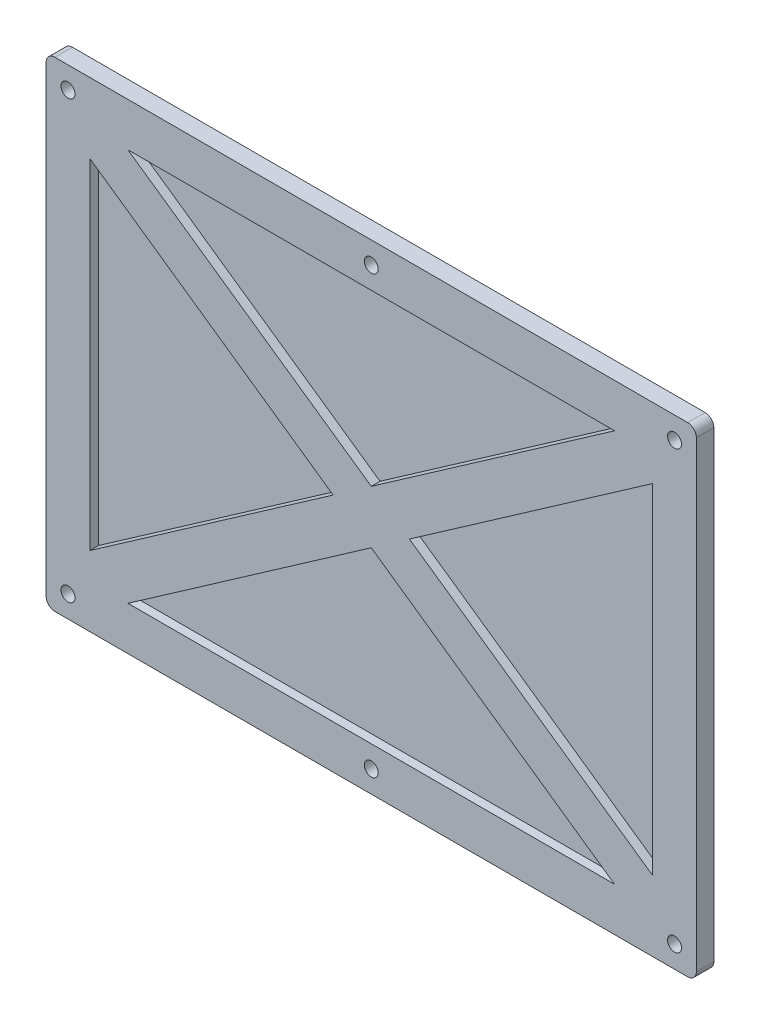
ISO-10303-21;
HEADER;
FILE_DESCRIPTION(('STEP AP214'),'2;1');
FILE_NAME('part.step','',(''),(''),'','','');
FILE_SCHEMA(('AUTOMOTIVE_DESIGN { 1 0 10303 214 1 1 1 1 }'));
ENDSEC;
DATA;
#1=APPLICATION_CONTEXT('core data for automotive mechanical design processes');
#2=APPLICATION_PROTOCOL_DEFINITION('international standard','automotive_design',2000,#1);
#3=PRODUCT_CONTEXT('',#1,'mechanical');
#4=PRODUCT('Part','Part','',(#3));
#5=PRODUCT_RELATED_PRODUCT_CATEGORY('part','',(#4));
#6=PRODUCT_DEFINITION_FORMATION('','',#4);
#7=PRODUCT_DEFINITION_CONTEXT('part definition',#1,'design');
#8=PRODUCT_DEFINITION('design','',#6,#7);
#9=PRODUCT_DEFINITION_SHAPE('','',#8);
#10=(LENGTH_UNIT() NAMED_UNIT(*) SI_UNIT(.MILLI.,.METRE.));
#11=(NAMED_UNIT(*) PLANE_ANGLE_UNIT() SI_UNIT($,.RADIAN.));
#12=(NAMED_UNIT(*) SI_UNIT($,.STERADIAN.) SOLID_ANGLE_UNIT());
#13=UNCERTAINTY_MEASURE_WITH_UNIT(LENGTH_MEASURE(1.E-05),#10,'distance_accuracy_value','');
#14=(GEOMETRIC_REPRESENTATION_CONTEXT(3) GLOBAL_UNCERTAINTY_ASSIGNED_CONTEXT((#13)) GLOBAL_UNIT_ASSIGNED_CONTEXT((#10,
#11,#12)) REPRESENTATION_CONTEXT('',''));
#15=CARTESIAN_POINT('',(0.,0.,0.));
#16=DIRECTION('',(0.,0.,1.));
#17=DIRECTION('',(1.,0.,0.));
#18=AXIS2_PLACEMENT_3D('',#15,#16,#17);
#19=CARTESIAN_POINT('',(0.,0.,0.));
#20=DIRECTION('',(0.,0.,-1.));
#21=DIRECTION('',(-1.,0.,0.));
#22=AXIS2_PLACEMENT_3D('',#19,#20,#21);
#23=PLANE('',#22);
#24=CARTESIAN_POINT('',(0.,50.,0.));
#25=DIRECTION('',(0.,0.,1.));
#26=DIRECTION('',(1.,0.,0.));
#27=AXIS2_PLACEMENT_3D('',#24,#25,#26);
#28=CIRCLE('',#27,1.6);
#29=CARTESIAN_POINT('',(1.60000000000001,50.,0.));
#30=VERTEX_POINT('',#29);
#31=EDGE_CURVE('E357',#30,#30,#28,.T.);
#32=ORIENTED_EDGE('',*,*,#31,.T.);
#33=EDGE_LOOP('',(#32));
#34=FACE_BOUND('',#33,.T.);
#35=CARTESIAN_POINT('',(69.5,-50.,0.));
#36=DIRECTION('',(0.,0.,1.));
#37=DIRECTION('',(1.,0.,0.));
#38=AXIS2_PLACEMENT_3D('',#35,#36,#37);
#39=CIRCLE('',#38,1.60000000000001);
#40=CARTESIAN_POINT('',(71.1,-50.,0.));
#41=VERTEX_POINT('',#40);
#42=EDGE_CURVE('E365',#41,#41,#39,.T.);
#43=ORIENTED_EDGE('',*,*,#42,.T.);
#44=EDGE_LOOP('',(#43));
#45=FACE_BOUND('',#44,.T.);
#46=CARTESIAN_POINT('',(-69.5,50.,0.));
#47=DIRECTION('',(0.,0.,1.));
#48=DIRECTION('',(1.,0.,0.));
#49=AXIS2_PLACEMENT_3D('',#46,#47,#48);
#50=CIRCLE('',#49,1.60000000000001);
#51=CARTESIAN_POINT('',(-67.9,50.,0.));
#52=VERTEX_POINT('',#51);
#53=EDGE_CURVE('E373',#52,#52,#50,.T.);
#54=ORIENTED_EDGE('',*,*,#53,.T.);
#55=EDGE_LOOP('',(#54));
#56=FACE_BOUND('',#55,.T.);
#57=DIRECTION('',(1.,0.,0.));
#58=VECTOR('',#57,1.);
#59=CARTESIAN_POINT('',(-74.5,-55.,0.));
#60=LINE('',#59,#58);
#61=CARTESIAN_POINT('',(-72.5,-55.,0.));
#62=VERTEX_POINT('',#61);
#63=CARTESIAN_POINT('',(72.5,-55.,0.));
#64=VERTEX_POINT('',#63);
#65=EDGE_CURVE('E388',#62,#64,#60,.T.);
#66=ORIENTED_EDGE('',*,*,#65,.F.);
#67=CARTESIAN_POINT('',(-72.5,-53.,0.));
#68=DIRECTION('',(0.,0.,-1.));
#69=DIRECTION('',(-1.,0.,0.));
#70=AXIS2_PLACEMENT_3D('',#67,#68,#69);
#71=CIRCLE('',#70,2.);
#72=CARTESIAN_POINT('',(-74.5,-53.,0.));
#73=VERTEX_POINT('',#72);
#74=EDGE_CURVE('E408',#62,#73,#71,.T.);
#75=ORIENTED_EDGE('',*,*,#74,.T.);
#76=DIRECTION('',(0.,-1.,0.));
#77=VECTOR('',#76,1.);
#78=CARTESIAN_POINT('',(-74.5,-55.,0.));
#79=LINE('',#78,#77);
#80=CARTESIAN_POINT('',(-74.5,53.,0.));
#81=VERTEX_POINT('',#80);
#82=EDGE_CURVE('E384',#81,#73,#79,.T.);
#83=ORIENTED_EDGE('',*,*,#82,.F.);
#84=CARTESIAN_POINT('',(-72.5,53.,0.));
#85=DIRECTION('',(0.,0.,-1.));
#86=DIRECTION('',(-1.,0.,0.));
#87=AXIS2_PLACEMENT_3D('',#84,#85,#86);
#88=CIRCLE('',#87,2.);
#89=CARTESIAN_POINT('',(-72.5,55.,0.));
#90=VERTEX_POINT('',#89);
#91=EDGE_CURVE('E399',#81,#90,#88,.T.);
#92=ORIENTED_EDGE('',*,*,#91,.T.);
#93=DIRECTION('',(-1.,0.,0.));
#94=VECTOR('',#93,1.);
#95=CARTESIAN_POINT('',(-74.5,55.,0.));
#96=LINE('',#95,#94);
#97=CARTESIAN_POINT('',(72.5,55.,0.));
#98=VERTEX_POINT('',#97);
#99=EDGE_CURVE('E380',#98,#90,#96,.T.);
#100=ORIENTED_EDGE('',*,*,#99,.F.);
#101=CARTESIAN_POINT('',(72.5,53.,0.));
#102=DIRECTION('',(0.,0.,-1.));
#103=DIRECTION('',(-1.,0.,0.));
#104=AXIS2_PLACEMENT_3D('',#101,#102,#103);
#105=CIRCLE('',#104,2.);
#106=CARTESIAN_POINT('',(74.5,53.,0.));
#107=VERTEX_POINT('',#106);
#108=EDGE_CURVE('E402',#98,#107,#105,.T.);
#109=ORIENTED_EDGE('',*,*,#108,.T.);
#110=DIRECTION('',(0.,1.,0.));
#111=VECTOR('',#110,1.);
#112=CARTESIAN_POINT('',(74.5,-55.,0.));
#113=LINE('',#112,#111);
#114=CARTESIAN_POINT('',(74.5,-53.,0.));
#115=VERTEX_POINT('',#114);
#116=EDGE_CURVE('E377',#115,#107,#113,.T.);
#117=ORIENTED_EDGE('',*,*,#116,.F.);
#118=CARTESIAN_POINT('',(72.5,-53.,0.));
#119=DIRECTION('',(0.,0.,-1.));
#120=DIRECTION('',(-1.,0.,0.));
#121=AXIS2_PLACEMENT_3D('',#118,#119,#120);
#122=CIRCLE('',#121,2.);
#123=EDGE_CURVE('E405',#115,#64,#122,.T.);
#124=ORIENTED_EDGE('',*,*,#123,.T.);
#125=EDGE_LOOP('',(#66,#75,#83,#92,#100,#109,#117,#124));
#126=FACE_BOUND('',#125,.T.);
#127=CARTESIAN_POINT('',(69.5,50.,0.));
#128=DIRECTION('',(0.,0.,1.));
#129=DIRECTION('',(1.,0.,0.));
#130=AXIS2_PLACEMENT_3D('',#127,#128,#129);
#131=CIRCLE('',#130,1.60000000000001);
#132=CARTESIAN_POINT('',(71.1,50.,0.));
#133=VERTEX_POINT('',#132);
#134=EDGE_CURVE('E369',#133,#133,#131,.T.);
#135=ORIENTED_EDGE('',*,*,#134,.T.);
#136=EDGE_LOOP('',(#135));
#137=FACE_BOUND('',#136,.T.);
#138=CARTESIAN_POINT('',(-69.5,-50.,0.));
#139=DIRECTION('',(0.,0.,1.));
#140=DIRECTION('',(1.,0.,0.));
#141=AXIS2_PLACEMENT_3D('',#138,#139,#140);
#142=CIRCLE('',#141,1.60000000000001);
#143=CARTESIAN_POINT('',(-67.9,-50.,0.));
#144=VERTEX_POINT('',#143);
#145=EDGE_CURVE('E361',#144,#144,#142,.T.);
#146=ORIENTED_EDGE('',*,*,#145,.T.);
#147=EDGE_LOOP('',(#146));
#148=FACE_BOUND('',#147,.T.);
#149=CARTESIAN_POINT('',(0.,-50.,0.));
#150=DIRECTION('',(0.,0.,1.));
#151=DIRECTION('',(1.,0.,0.));
#152=AXIS2_PLACEMENT_3D('',#149,#150,#151);
#153=CIRCLE('',#152,1.6);
#154=CARTESIAN_POINT('',(1.60000000000001,-50.,0.));
#155=VERTEX_POINT('',#154);
#156=EDGE_CURVE('E353',#155,#155,#153,.T.);
#157=ORIENTED_EDGE('',*,*,#156,.T.);
#158=EDGE_LOOP('',(#157));
#159=FACE_BOUND('',#158,.T.);
#160=ADVANCED_FACE('F42',(#34,#45,#56,#126,#137,#148,#159),#23,.T.);
#161=CARTESIAN_POINT('',(74.5,-55.,2.));
#162=DIRECTION('',(-1.,0.,0.));
#163=DIRECTION('',(0.,0.,1.));
#164=AXIS2_PLACEMENT_3D('',#161,#162,#163);
#165=PLANE('',#164);
#166=DIRECTION('',(0.,1.,0.));
#167=VECTOR('',#166,1.);
#168=CARTESIAN_POINT('',(74.5,-55.,4.));
#169=LINE('',#168,#167);
#170=CARTESIAN_POINT('',(74.5,-53.,4.));
#171=VERTEX_POINT('',#170);
#172=CARTESIAN_POINT('',(74.5,53.,4.));
#173=VERTEX_POINT('',#172);
#174=EDGE_CURVE('E350',#171,#173,#169,.T.);
#175=ORIENTED_EDGE('',*,*,#174,.F.);
#176=DIRECTION('',(0.,0.,-1.));
#177=VECTOR('',#176,1.);
#178=CARTESIAN_POINT('',(74.5,-53.,2.));
#179=LINE('',#178,#177);
#180=EDGE_CURVE('E431',#171,#115,#179,.T.);
#181=ORIENTED_EDGE('',*,*,#180,.T.);
#182=ORIENTED_EDGE('',*,*,#116,.T.);
#183=DIRECTION('',(0.,0.,-1.));
#184=VECTOR('',#183,1.);
#185=CARTESIAN_POINT('',(74.5,53.,2.));
#186=LINE('',#185,#184);
#187=EDGE_CURVE('E58',#107,#173,#186,.F.);
#188=ORIENTED_EDGE('',*,*,#187,.T.);
#189=EDGE_LOOP('',(#175,#181,#182,#188));
#190=FACE_BOUND('',#189,.T.);
#191=ADVANCED_FACE('F466',(#190),#165,.F.);
#192=CARTESIAN_POINT('',(-74.5,55.,2.));
#193=DIRECTION('',(0.,-1.,0.));
#194=DIRECTION('',(0.,0.,-1.));
#195=AXIS2_PLACEMENT_3D('',#192,#193,#194);
#196=PLANE('',#195);
#197=DIRECTION('',(-1.,0.,0.));
#198=VECTOR('',#197,1.);
#199=CARTESIAN_POINT('',(74.5,55.,4.));
#200=LINE('',#199,#198);
#201=CARTESIAN_POINT('',(72.5,55.,4.));
#202=VERTEX_POINT('',#201);
#203=CARTESIAN_POINT('',(-72.5,55.,4.));
#204=VERTEX_POINT('',#203);
#205=EDGE_CURVE('E339',#202,#204,#200,.T.);
#206=ORIENTED_EDGE('',*,*,#205,.F.);
#207=DIRECTION('',(0.,0.,-1.));
#208=VECTOR('',#207,1.);
#209=CARTESIAN_POINT('',(72.5,55.,2.));
#210=LINE('',#209,#208);
#211=EDGE_CURVE('E11',#202,#98,#210,.T.);
#212=ORIENTED_EDGE('',*,*,#211,.T.);
#213=ORIENTED_EDGE('',*,*,#99,.T.);
#214=DIRECTION('',(0.,0.,-1.));
#215=VECTOR('',#214,1.);
#216=CARTESIAN_POINT('',(-72.5,55.,2.));
#217=LINE('',#216,#215);
#218=EDGE_CURVE('E51',#90,#204,#217,.F.);
#219=ORIENTED_EDGE('',*,*,#218,.T.);
#220=EDGE_LOOP('',(#206,#212,#213,#219));
#221=FACE_BOUND('',#220,.T.);
#222=ADVANCED_FACE('F438',(#221),#196,.F.);
#223=CARTESIAN_POINT('',(-74.5,-55.,2.));
#224=DIRECTION('',(1.,0.,0.));
#225=DIRECTION('',(0.,0.,-1.));
#226=AXIS2_PLACEMENT_3D('',#223,#224,#225);
#227=PLANE('',#226);
#228=ORIENTED_EDGE('',*,*,#82,.T.);
#229=DIRECTION('',(0.,0.,-1.));
#230=VECTOR('',#229,1.);
#231=CARTESIAN_POINT('',(-74.5,-53.,2.));
#232=LINE('',#231,#230);
#233=CARTESIAN_POINT('',(-74.5,-53.,4.));
#234=VERTEX_POINT('',#233);
#235=EDGE_CURVE('E415',#73,#234,#232,.F.);
#236=ORIENTED_EDGE('',*,*,#235,.T.);
#237=DIRECTION('',(0.,-1.,0.));
#238=VECTOR('',#237,1.);
#239=CARTESIAN_POINT('',(-74.5,55.,4.));
#240=LINE('',#239,#238);
#241=CARTESIAN_POINT('',(-74.5,53.,4.));
#242=VERTEX_POINT('',#241);
#243=EDGE_CURVE('E343',#242,#234,#240,.T.);
#244=ORIENTED_EDGE('',*,*,#243,.F.);
#245=DIRECTION('',(0.,0.,-1.));
#246=VECTOR('',#245,1.);
#247=CARTESIAN_POINT('',(-74.5,53.,2.));
#248=LINE('',#247,#246);
#249=EDGE_CURVE('E411',#242,#81,#248,.T.);
#250=ORIENTED_EDGE('',*,*,#249,.T.);
#251=EDGE_LOOP('',(#228,#236,#244,#250));
#252=FACE_BOUND('',#251,.T.);
#253=ADVANCED_FACE('F449',(#252),#227,.F.);
#254=CARTESIAN_POINT('',(-74.5,-55.,2.));
#255=DIRECTION('',(0.,1.,0.));
#256=DIRECTION('',(0.,0.,1.));
#257=AXIS2_PLACEMENT_3D('',#254,#255,#256);
#258=PLANE('',#257);
#259=DIRECTION('',(1.,0.,0.));
#260=VECTOR('',#259,1.);
#261=CARTESIAN_POINT('',(-74.5,-55.,4.));
#262=LINE('',#261,#260);
#263=CARTESIAN_POINT('',(-72.5,-55.,4.));
#264=VERTEX_POINT('',#263);
#265=CARTESIAN_POINT('',(72.5,-55.,4.));
#266=VERTEX_POINT('',#265);
#267=EDGE_CURVE('E347',#264,#266,#262,.T.);
#268=ORIENTED_EDGE('',*,*,#267,.F.);
#269=DIRECTION('',(0.,0.,-1.));
#270=VECTOR('',#269,1.);
#271=CARTESIAN_POINT('',(-72.5,-55.,2.));
#272=LINE('',#271,#270);
#273=EDGE_CURVE('E395',#264,#62,#272,.T.);
#274=ORIENTED_EDGE('',*,*,#273,.T.);
#275=ORIENTED_EDGE('',*,*,#65,.T.);
#276=DIRECTION('',(0.,0.,-1.));
#277=VECTOR('',#276,1.);
#278=CARTESIAN_POINT('',(72.5,-55.,2.));
#279=LINE('',#278,#277);
#280=EDGE_CURVE('E392',#64,#266,#279,.F.);
#281=ORIENTED_EDGE('',*,*,#280,.T.);
#282=EDGE_LOOP('',(#268,#274,#275,#281));
#283=FACE_BOUND('',#282,.T.);
#284=ADVANCED_FACE('F460',(#283),#258,.F.);
#285=CARTESIAN_POINT('',(-69.5,50.,2.));
#286=DIRECTION('',(0.,0.,-1.));
#287=DIRECTION('',(-1.,0.,0.));
#288=AXIS2_PLACEMENT_3D('',#285,#286,#287);
#289=CYLINDRICAL_SURFACE('',#288,1.60000000000001);
#290=ORIENTED_EDGE('',*,*,#53,.F.);
#291=EDGE_LOOP('',(#290));
#292=FACE_BOUND('',#291,.T.);
#293=CARTESIAN_POINT('',(-69.5,50.,4.));
#294=DIRECTION('',(0.,0.,1.));
#295=DIRECTION('',(1.,0.,0.));
#296=AXIS2_PLACEMENT_3D('',#293,#294,#295);
#297=CIRCLE('',#296,1.60000000000001);
#298=CARTESIAN_POINT('',(-67.9,50.,4.));
#299=VERTEX_POINT('',#298);
#300=EDGE_CURVE('E323',#299,#299,#297,.T.);
#301=ORIENTED_EDGE('',*,*,#300,.T.);
#302=EDGE_LOOP('',(#301));
#303=FACE_BOUND('',#302,.T.);
#304=ADVANCED_FACE('F490',(#292,#303),#289,.F.);
#305=CARTESIAN_POINT('',(69.5,50.,2.));
#306=DIRECTION('',(0.,0.,-1.));
#307=DIRECTION('',(-1.,0.,0.));
#308=AXIS2_PLACEMENT_3D('',#305,#306,#307);
#309=CYLINDRICAL_SURFACE('',#308,1.60000000000001);
#310=ORIENTED_EDGE('',*,*,#134,.F.);
#311=EDGE_LOOP('',(#310));
#312=FACE_BOUND('',#311,.T.);
#313=CARTESIAN_POINT('',(69.5,50.,4.));
#314=DIRECTION('',(0.,0.,1.));
#315=DIRECTION('',(1.,0.,0.));
#316=AXIS2_PLACEMENT_3D('',#313,#314,#315);
#317=CIRCLE('',#316,1.60000000000001);
#318=CARTESIAN_POINT('',(71.1,50.,4.));
#319=VERTEX_POINT('',#318);
#320=EDGE_CURVE('E327',#319,#319,#317,.T.);
#321=ORIENTED_EDGE('',*,*,#320,.T.);
#322=EDGE_LOOP('',(#321));
#323=FACE_BOUND('',#322,.T.);
#324=ADVANCED_FACE('F592',(#312,#323),#309,.F.);
#325=CARTESIAN_POINT('',(69.5,-50.,2.));
#326=DIRECTION('',(0.,0.,-1.));
#327=DIRECTION('',(-1.,0.,0.));
#328=AXIS2_PLACEMENT_3D('',#325,#326,#327);
#329=CYLINDRICAL_SURFACE('',#328,1.60000000000001);
#330=ORIENTED_EDGE('',*,*,#42,.F.);
#331=EDGE_LOOP('',(#330));
#332=FACE_BOUND('',#331,.T.);
#333=CARTESIAN_POINT('',(69.5,-50.,4.));
#334=DIRECTION('',(0.,0.,1.));
#335=DIRECTION('',(1.,0.,0.));
#336=AXIS2_PLACEMENT_3D('',#333,#334,#335);
#337=CIRCLE('',#336,1.60000000000001);
#338=CARTESIAN_POINT('',(71.1,-50.,4.));
#339=VERTEX_POINT('',#338);
#340=EDGE_CURVE('E331',#339,#339,#337,.T.);
#341=ORIENTED_EDGE('',*,*,#340,.T.);
#342=EDGE_LOOP('',(#341));
#343=FACE_BOUND('',#342,.T.);
#344=ADVANCED_FACE('F588',(#332,#343),#329,.F.);
#345=CARTESIAN_POINT('',(-69.5,-50.,2.));
#346=DIRECTION('',(0.,0.,-1.));
#347=DIRECTION('',(-1.,0.,0.));
#348=AXIS2_PLACEMENT_3D('',#345,#346,#347);
#349=CYLINDRICAL_SURFACE('',#348,1.60000000000001);
#350=ORIENTED_EDGE('',*,*,#145,.F.);
#351=EDGE_LOOP('',(#350));
#352=FACE_BOUND('',#351,.T.);
#353=CARTESIAN_POINT('',(-69.5,-50.,4.));
#354=DIRECTION('',(0.,0.,1.));
#355=DIRECTION('',(1.,0.,0.));
#356=AXIS2_PLACEMENT_3D('',#353,#354,#355);
#357=CIRCLE('',#356,1.60000000000001);
#358=CARTESIAN_POINT('',(-67.9,-50.,4.));
#359=VERTEX_POINT('',#358);
#360=EDGE_CURVE('E335',#359,#359,#357,.T.);
#361=ORIENTED_EDGE('',*,*,#360,.T.);
#362=EDGE_LOOP('',(#361));
#363=FACE_BOUND('',#362,.T.);
#364=ADVANCED_FACE('F584',(#352,#363),#349,.F.);
#365=CARTESIAN_POINT('',(0.,50.,2.));
#366=DIRECTION('',(0.,0.,-1.));
#367=DIRECTION('',(-1.,0.,0.));
#368=AXIS2_PLACEMENT_3D('',#365,#366,#367);
#369=CYLINDRICAL_SURFACE('',#368,1.6);
#370=ORIENTED_EDGE('',*,*,#31,.F.);
#371=EDGE_LOOP('',(#370));
#372=FACE_BOUND('',#371,.T.);
#373=CARTESIAN_POINT('',(0.,50.,4.));
#374=DIRECTION('',(0.,0.,1.));
#375=DIRECTION('',(1.,0.,0.));
#376=AXIS2_PLACEMENT_3D('',#373,#374,#375);
#377=CIRCLE('',#376,1.6);
#378=CARTESIAN_POINT('',(1.60000000000001,50.,4.));
#379=VERTEX_POINT('',#378);
#380=EDGE_CURVE('E901',#379,#379,#377,.T.);
#381=ORIENTED_EDGE('',*,*,#380,.T.);
#382=EDGE_LOOP('',(#381));
#383=FACE_BOUND('',#382,.T.);
#384=ADVANCED_FACE('F580',(#372,#383),#369,.F.);
#385=CARTESIAN_POINT('',(0.,-50.,2.));
#386=DIRECTION('',(0.,0.,-1.));
#387=DIRECTION('',(-1.,0.,0.));
#388=AXIS2_PLACEMENT_3D('',#385,#386,#387);
#389=CYLINDRICAL_SURFACE('',#388,1.6);
#390=ORIENTED_EDGE('',*,*,#156,.F.);
#391=EDGE_LOOP('',(#390));
#392=FACE_BOUND('',#391,.T.);
#393=CARTESIAN_POINT('',(0.,-50.,4.));
#394=DIRECTION('',(0.,0.,1.));
#395=DIRECTION('',(1.,0.,0.));
#396=AXIS2_PLACEMENT_3D('',#393,#394,#395);
#397=CIRCLE('',#396,1.6);
#398=CARTESIAN_POINT('',(1.60000000000001,-50.,4.));
#399=VERTEX_POINT('',#398);
#400=EDGE_CURVE('E218',#399,#399,#397,.T.);
#401=ORIENTED_EDGE('',*,*,#400,.T.);
#402=EDGE_LOOP('',(#401));
#403=FACE_BOUND('',#402,.T.);
#404=ADVANCED_FACE('F533',(#392,#403),#389,.F.);
#405=CARTESIAN_POINT('',(0.,0.,4.));
#406=DIRECTION('',(0.,0.,1.));
#407=DIRECTION('',(1.,0.,0.));
#408=AXIS2_PLACEMENT_3D('',#405,#406,#407);
#409=PLANE('',#408);
#410=ORIENTED_EDGE('',*,*,#400,.F.);
#411=EDGE_LOOP('',(#410));
#412=FACE_BOUND('',#411,.T.);
#413=ORIENTED_EDGE('',*,*,#320,.F.);
#414=EDGE_LOOP('',(#413));
#415=FACE_BOUND('',#414,.T.);
#416=ORIENTED_EDGE('',*,*,#360,.F.);
#417=EDGE_LOOP('',(#416));
#418=FACE_BOUND('',#417,.T.);
#419=ORIENTED_EDGE('',*,*,#243,.T.);
#420=CARTESIAN_POINT('',(-72.5,-53.,4.));
#421=DIRECTION('',(0.,0.,1.));
#422=DIRECTION('',(1.,0.,0.));
#423=AXIS2_PLACEMENT_3D('',#420,#421,#422);
#424=CIRCLE('',#423,2.);
#425=EDGE_CURVE('E426',#234,#264,#424,.T.);
#426=ORIENTED_EDGE('',*,*,#425,.T.);
#427=ORIENTED_EDGE('',*,*,#267,.T.);
#428=CARTESIAN_POINT('',(72.5,-53.,4.));
#429=DIRECTION('',(0.,0.,1.));
#430=DIRECTION('',(1.,0.,0.));
#431=AXIS2_PLACEMENT_3D('',#428,#429,#430);
#432=CIRCLE('',#431,2.);
#433=EDGE_CURVE('E65',#266,#171,#432,.T.);
#434=ORIENTED_EDGE('',*,*,#433,.T.);
#435=ORIENTED_EDGE('',*,*,#174,.T.);
#436=CARTESIAN_POINT('',(72.5,53.,4.));
#437=DIRECTION('',(0.,0.,1.));
#438=DIRECTION('',(1.,0.,0.));
#439=AXIS2_PLACEMENT_3D('',#436,#437,#438);
#440=CIRCLE('',#439,2.);
#441=EDGE_CURVE('E421',#173,#202,#440,.T.);
#442=ORIENTED_EDGE('',*,*,#441,.T.);
#443=ORIENTED_EDGE('',*,*,#205,.T.);
#444=CARTESIAN_POINT('',(-72.5,53.,4.));
#445=DIRECTION('',(0.,0.,1.));
#446=DIRECTION('',(1.,0.,0.));
#447=AXIS2_PLACEMENT_3D('',#444,#445,#446);
#448=CIRCLE('',#447,2.);
#449=EDGE_CURVE('E418',#204,#242,#448,.T.);
#450=ORIENTED_EDGE('',*,*,#449,.T.);
#451=EDGE_LOOP('',(#419,#426,#427,#434,#435,#442,#443,#450));
#452=FACE_BOUND('',#451,.T.);
#453=ORIENTED_EDGE('',*,*,#340,.F.);
#454=EDGE_LOOP('',(#453));
#455=FACE_BOUND('',#454,.T.);
#456=ORIENTED_EDGE('',*,*,#300,.F.);
#457=EDGE_LOOP('',(#456));
#458=FACE_BOUND('',#457,.T.);
#459=DIRECTION('',(0.820126954301183,0.572181596024082,0.));
#460=VECTOR('',#459,1.);
#461=CARTESIAN_POINT('',(0.,6.09661708321783,4.));
#462=LINE('',#461,#460);
#463=CARTESIAN_POINT('',(0.,6.09661708321783,4.));
#464=VERTEX_POINT('',#463);
#465=CARTESIAN_POINT('',(55.7615155140544,45.,4.));
#466=VERTEX_POINT('',#465);
#467=EDGE_CURVE('E295',#464,#466,#462,.T.);
#468=ORIENTED_EDGE('',*,*,#467,.F.);
#469=DIRECTION('',(0.820126954301183,-0.572181596024081,0.));
#470=VECTOR('',#469,1.);
#471=CARTESIAN_POINT('',(-55.7615155140545,45.,4.));
#472=LINE('',#471,#470);
#473=CARTESIAN_POINT('',(-55.7615155140545,45.,4.));
#474=VERTEX_POINT('',#473);
#475=EDGE_CURVE('E292',#474,#464,#472,.T.);
#476=ORIENTED_EDGE('',*,*,#475,.F.);
#477=DIRECTION('',(-1.,0.,0.));
#478=VECTOR('',#477,1.);
#479=CARTESIAN_POINT('',(55.7615155140544,45.,4.));
#480=LINE('',#479,#478);
#481=EDGE_CURVE('E300',#466,#474,#480,.T.);
#482=ORIENTED_EDGE('',*,*,#481,.F.);
#483=EDGE_LOOP('',(#468,#476,#482));
#484=FACE_BOUND('',#483,.T.);
#485=DIRECTION('',(0.,1.,0.));
#486=VECTOR('',#485,1.);
#487=CARTESIAN_POINT('',(64.5,-38.9033829167821,4.));
#488=LINE('',#487,#486);
#489=CARTESIAN_POINT('',(64.5,-38.9033829167821,4.));
#490=VERTEX_POINT('',#489);
#491=CARTESIAN_POINT('',(64.5,38.9033829167822,4.));
#492=VERTEX_POINT('',#491);
#493=EDGE_CURVE('E263',#490,#492,#488,.T.);
#494=ORIENTED_EDGE('',*,*,#493,.F.);
#495=DIRECTION('',(0.820126954301183,-0.572181596024082,0.));
#496=VECTOR('',#495,1.);
#497=CARTESIAN_POINT('',(8.73848448594557,0.,4.));
#498=LINE('',#497,#496);
#499=CARTESIAN_POINT('',(8.73848448594557,0.,4.));
#500=VERTEX_POINT('',#499);
#501=EDGE_CURVE('E260',#500,#490,#498,.T.);
#502=ORIENTED_EDGE('',*,*,#501,.F.);
#503=DIRECTION('',(-0.820126954301183,-0.572181596024081,0.));
#504=VECTOR('',#503,1.);
#505=CARTESIAN_POINT('',(64.5,38.9033829167822,4.));
#506=LINE('',#505,#504);
#507=EDGE_CURVE('E268',#492,#500,#506,.T.);
#508=ORIENTED_EDGE('',*,*,#507,.F.);
#509=EDGE_LOOP('',(#494,#502,#508));
#510=FACE_BOUND('',#509,.T.);
#511=DIRECTION('',(-0.820126954301183,-0.572181596024081,0.));
#512=VECTOR('',#511,1.);
#513=CARTESIAN_POINT('',(0.,-6.09661708321783,4.));
#514=LINE('',#513,#512);
#515=CARTESIAN_POINT('',(0.,-6.09661708321783,4.));
#516=VERTEX_POINT('',#515);
#517=CARTESIAN_POINT('',(-55.7615155140545,-45.,4.));
#518=VERTEX_POINT('',#517);
#519=EDGE_CURVE('E231',#516,#518,#514,.T.);
#520=ORIENTED_EDGE('',*,*,#519,.F.);
#521=DIRECTION('',(-0.820126954301183,0.572181596024081,0.));
#522=VECTOR('',#521,1.);
#523=CARTESIAN_POINT('',(55.7615155140544,-45.,4.));
#524=LINE('',#523,#522);
#525=CARTESIAN_POINT('',(55.7615155140544,-45.,4.));
#526=VERTEX_POINT('',#525);
#527=EDGE_CURVE('E228',#526,#516,#524,.T.);
#528=ORIENTED_EDGE('',*,*,#527,.F.);
#529=DIRECTION('',(1.,0.,0.));
#530=VECTOR('',#529,1.);
#531=CARTESIAN_POINT('',(55.7615155140544,-45.,4.));
#532=LINE('',#531,#530);
#533=EDGE_CURVE('E236',#518,#526,#532,.T.);
#534=ORIENTED_EDGE('',*,*,#533,.F.);
#535=EDGE_LOOP('',(#520,#528,#534));
#536=FACE_BOUND('',#535,.T.);
#537=DIRECTION('',(0.,-1.,0.));
#538=VECTOR('',#537,1.);
#539=CARTESIAN_POINT('',(-64.5,-38.9033829167822,4.));
#540=LINE('',#539,#538);
#541=CARTESIAN_POINT('',(-64.5,38.9033829167821,4.));
#542=VERTEX_POINT('',#541);
#543=CARTESIAN_POINT('',(-64.5,-38.9033829167822,4.));
#544=VERTEX_POINT('',#543);
#545=EDGE_CURVE('E194',#542,#544,#540,.T.);
#546=ORIENTED_EDGE('',*,*,#545,.F.);
#547=DIRECTION('',(-0.820126954301183,0.572181596024082,0.));
#548=VECTOR('',#547,1.);
#549=CARTESIAN_POINT('',(-8.73848448594559,0.,4.));
#550=LINE('',#549,#548);
#551=CARTESIAN_POINT('',(-8.73848448594559,0.,4.));
#552=VERTEX_POINT('',#551);
#553=EDGE_CURVE('E183',#552,#542,#550,.T.);
#554=ORIENTED_EDGE('',*,*,#553,.F.);
#555=DIRECTION('',(0.820126954301183,0.572181596024082,0.));
#556=VECTOR('',#555,1.);
#557=CARTESIAN_POINT('',(-64.5,-38.9033829167822,4.));
#558=LINE('',#557,#556);
#559=EDGE_CURVE('E208',#544,#552,#558,.T.);
#560=ORIENTED_EDGE('',*,*,#559,.F.);
#561=EDGE_LOOP('',(#546,#554,#560));
#562=FACE_BOUND('',#561,.T.);
#563=ORIENTED_EDGE('',*,*,#380,.F.);
#564=EDGE_LOOP('',(#563));
#565=FACE_BOUND('',#564,.T.);
#566=ADVANCED_FACE('F206',(#412,#415,#418,#452,#455,#458,#484,#510,#536,#562,#565),#409,.T.);
#567=CARTESIAN_POINT('',(-55.7615155140545,45.,4.));
#568=DIRECTION('',(0.572181596024081,0.820126954301183,0.));
#569=DIRECTION('',(-0.820126954301183,0.572181596024081,0.));
#570=AXIS2_PLACEMENT_3D('',#567,#568,#569);
#571=PLANE('',#570);
#572=DIRECTION('',(0.820126954301183,-0.572181596024081,0.));
#573=VECTOR('',#572,1.);
#574=CARTESIAN_POINT('',(-55.7615155140545,45.,2.));
#575=LINE('',#574,#573);
#576=CARTESIAN_POINT('',(-55.7615155140545,45.,2.));
#577=VERTEX_POINT('',#576);
#578=CARTESIAN_POINT('',(0.,6.09661708321783,2.));
#579=VERTEX_POINT('',#578);
#580=EDGE_CURVE('E291',#577,#579,#575,.T.);
#581=ORIENTED_EDGE('',*,*,#580,.F.);
#582=DIRECTION('',(0.,0.,-1.));
#583=VECTOR('',#582,1.);
#584=CARTESIAN_POINT('',(-55.7615155140545,45.,4.));
#585=LINE('',#584,#583);
#586=EDGE_CURVE('E303',#474,#577,#585,.T.);
#587=ORIENTED_EDGE('',*,*,#586,.F.);
#588=ORIENTED_EDGE('',*,*,#475,.T.);
#589=DIRECTION('',(0.,0.,-1.));
#590=VECTOR('',#589,1.);
#591=CARTESIAN_POINT('',(0.,6.09661708321783,4.));
#592=LINE('',#591,#590);
#593=EDGE_CURVE('E319',#464,#579,#592,.T.);
#594=ORIENTED_EDGE('',*,*,#593,.T.);
#595=EDGE_LOOP('',(#581,#587,#588,#594));
#596=FACE_BOUND('',#595,.T.);
#597=ADVANCED_FACE('F532',(#596),#571,.T.);
#598=CARTESIAN_POINT('',(0.,6.09661708321783,4.));
#599=DIRECTION('',(-0.572181596024082,0.820126954301183,0.));
#600=DIRECTION('',(-0.820126954301183,-0.572181596024082,0.));
#601=AXIS2_PLACEMENT_3D('',#598,#599,#600);
#602=PLANE('',#601);
#603=DIRECTION('',(0.820126954301183,0.572181596024082,0.));
#604=VECTOR('',#603,1.);
#605=CARTESIAN_POINT('',(0.,6.09661708321783,2.));
#606=LINE('',#605,#604);
#607=CARTESIAN_POINT('',(55.7615155140544,45.,2.));
#608=VERTEX_POINT('',#607);
#609=EDGE_CURVE('E307',#579,#608,#606,.T.);
#610=ORIENTED_EDGE('',*,*,#609,.F.);
#611=ORIENTED_EDGE('',*,*,#593,.F.);
#612=ORIENTED_EDGE('',*,*,#467,.T.);
#613=DIRECTION('',(0.,0.,-1.));
#614=VECTOR('',#613,1.);
#615=CARTESIAN_POINT('',(55.7615155140544,45.,4.));
#616=LINE('',#615,#614);
#617=EDGE_CURVE('E316',#466,#608,#616,.T.);
#618=ORIENTED_EDGE('',*,*,#617,.T.);
#619=EDGE_LOOP('',(#610,#611,#612,#618));
#620=FACE_BOUND('',#619,.T.);
#621=ADVANCED_FACE('F570',(#620),#602,.T.);
#622=CARTESIAN_POINT('',(55.7615155140544,45.,4.));
#623=DIRECTION('',(0.,-1.,0.));
#624=DIRECTION('',(1.,0.,0.));
#625=AXIS2_PLACEMENT_3D('',#622,#623,#624);
#626=PLANE('',#625);
#627=DIRECTION('',(-1.,0.,0.));
#628=VECTOR('',#627,1.);
#629=CARTESIAN_POINT('',(55.7615155140544,45.,2.));
#630=LINE('',#629,#628);
#631=EDGE_CURVE('E296',#608,#577,#630,.T.);
#632=ORIENTED_EDGE('',*,*,#631,.F.);
#633=ORIENTED_EDGE('',*,*,#617,.F.);
#634=ORIENTED_EDGE('',*,*,#481,.T.);
#635=ORIENTED_EDGE('',*,*,#586,.T.);
#636=EDGE_LOOP('',(#632,#633,#634,#635));
#637=FACE_BOUND('',#636,.T.);
#638=ADVANCED_FACE('F567',(#637),#626,.T.);
#639=CARTESIAN_POINT('',(8.73848448594557,0.,4.));
#640=DIRECTION('',(0.572181596024082,0.820126954301183,0.));
#641=DIRECTION('',(-0.820126954301183,0.572181596024082,0.));
#642=AXIS2_PLACEMENT_3D('',#639,#640,#641);
#643=PLANE('',#642);
#644=DIRECTION('',(0.820126954301183,-0.572181596024082,0.));
#645=VECTOR('',#644,1.);
#646=CARTESIAN_POINT('',(8.73848448594557,0.,2.));
#647=LINE('',#646,#645);
#648=CARTESIAN_POINT('',(8.73848448594557,0.,2.));
#649=VERTEX_POINT('',#648);
#650=CARTESIAN_POINT('',(64.5,-38.9033829167821,2.));
#651=VERTEX_POINT('',#650);
#652=EDGE_CURVE('E259',#649,#651,#647,.T.);
#653=ORIENTED_EDGE('',*,*,#652,.F.);
#654=DIRECTION('',(0.,0.,-1.));
#655=VECTOR('',#654,1.);
#656=CARTESIAN_POINT('',(8.73848448594557,0.,4.));
#657=LINE('',#656,#655);
#658=EDGE_CURVE('E271',#500,#649,#657,.T.);
#659=ORIENTED_EDGE('',*,*,#658,.F.);
#660=ORIENTED_EDGE('',*,*,#501,.T.);
#661=DIRECTION('',(0.,0.,-1.));
#662=VECTOR('',#661,1.);
#663=CARTESIAN_POINT('',(64.5,-38.9033829167821,4.));
#664=LINE('',#663,#662);
#665=EDGE_CURVE('E287',#490,#651,#664,.T.);
#666=ORIENTED_EDGE('',*,*,#665,.T.);
#667=EDGE_LOOP('',(#653,#659,#660,#666));
#668=FACE_BOUND('',#667,.T.);
#669=ADVANCED_FACE('F524',(#668),#643,.T.);
#670=CARTESIAN_POINT('',(64.5,-38.9033829167821,4.));
#671=DIRECTION('',(-1.,0.,0.));
#672=DIRECTION('',(0.,0.,1.));
#673=AXIS2_PLACEMENT_3D('',#670,#671,#672);
#674=PLANE('',#673);
#675=DIRECTION('',(0.,1.,0.));
#676=VECTOR('',#675,1.);
#677=CARTESIAN_POINT('',(64.5,-38.9033829167821,2.));
#678=LINE('',#677,#676);
#679=CARTESIAN_POINT('',(64.5,38.9033829167822,2.));
#680=VERTEX_POINT('',#679);
#681=EDGE_CURVE('E275',#651,#680,#678,.T.);
#682=ORIENTED_EDGE('',*,*,#681,.F.);
#683=ORIENTED_EDGE('',*,*,#665,.F.);
#684=ORIENTED_EDGE('',*,*,#493,.T.);
#685=DIRECTION('',(0.,0.,-1.));
#686=VECTOR('',#685,1.);
#687=CARTESIAN_POINT('',(64.5,38.9033829167822,4.));
#688=LINE('',#687,#686);
#689=EDGE_CURVE('E284',#492,#680,#688,.T.);
#690=ORIENTED_EDGE('',*,*,#689,.T.);
#691=EDGE_LOOP('',(#682,#683,#684,#690));
#692=FACE_BOUND('',#691,.T.);
#693=ADVANCED_FACE('F528',(#692),#674,.T.);
#694=CARTESIAN_POINT('',(64.5,38.9033829167822,4.));
#695=DIRECTION('',(0.572181596024081,-0.820126954301183,0.));
#696=DIRECTION('',(0.820126954301183,0.572181596024081,0.));
#697=AXIS2_PLACEMENT_3D('',#694,#695,#696);
#698=PLANE('',#697);
#699=DIRECTION('',(-0.820126954301183,-0.572181596024081,0.));
#700=VECTOR('',#699,1.);
#701=CARTESIAN_POINT('',(64.5,38.9033829167822,2.));
#702=LINE('',#701,#700);
#703=EDGE_CURVE('E264',#680,#649,#702,.T.);
#704=ORIENTED_EDGE('',*,*,#703,.F.);
#705=ORIENTED_EDGE('',*,*,#689,.F.);
#706=ORIENTED_EDGE('',*,*,#507,.T.);
#707=ORIENTED_EDGE('',*,*,#658,.T.);
#708=EDGE_LOOP('',(#704,#705,#706,#707));
#709=FACE_BOUND('',#708,.T.);
#710=ADVANCED_FACE('F519',(#709),#698,.T.);
#711=CARTESIAN_POINT('',(55.7615155140544,-45.,4.));
#712=DIRECTION('',(-0.572181596024081,-0.820126954301183,0.));
#713=DIRECTION('',(0.820126954301183,-0.572181596024081,0.));
#714=AXIS2_PLACEMENT_3D('',#711,#712,#713);
#715=PLANE('',#714);
#716=DIRECTION('',(-0.820126954301183,0.572181596024081,0.));
#717=VECTOR('',#716,1.);
#718=CARTESIAN_POINT('',(55.7615155140544,-45.,2.));
#719=LINE('',#718,#717);
#720=CARTESIAN_POINT('',(55.7615155140544,-45.,2.));
#721=VERTEX_POINT('',#720);
#722=CARTESIAN_POINT('',(0.,-6.09661708321783,2.));
#723=VERTEX_POINT('',#722);
#724=EDGE_CURVE('E203',#721,#723,#719,.T.);
#725=ORIENTED_EDGE('',*,*,#724,.F.);
#726=DIRECTION('',(0.,0.,-1.));
#727=VECTOR('',#726,1.);
#728=CARTESIAN_POINT('',(55.7615155140544,-45.,4.));
#729=LINE('',#728,#727);
#730=EDGE_CURVE('E239',#526,#721,#729,.T.);
#731=ORIENTED_EDGE('',*,*,#730,.F.);
#732=ORIENTED_EDGE('',*,*,#527,.T.);
#733=DIRECTION('',(0.,0.,-1.));
#734=VECTOR('',#733,1.);
#735=CARTESIAN_POINT('',(0.,-6.09661708321783,4.));
#736=LINE('',#735,#734);
#737=EDGE_CURVE('E255',#516,#723,#736,.T.);
#738=ORIENTED_EDGE('',*,*,#737,.T.);
#739=EDGE_LOOP('',(#725,#731,#732,#738));
#740=FACE_BOUND('',#739,.T.);
#741=ADVANCED_FACE('F545',(#740),#715,.T.);
#742=CARTESIAN_POINT('',(0.,-6.09661708321783,4.));
#743=DIRECTION('',(0.572181596024081,-0.820126954301183,0.));
#744=DIRECTION('',(0.820126954301183,0.572181596024081,0.));
#745=AXIS2_PLACEMENT_3D('',#742,#743,#744);
#746=PLANE('',#745);
#747=DIRECTION('',(-0.820126954301183,-0.572181596024081,0.));
#748=VECTOR('',#747,1.);
#749=CARTESIAN_POINT('',(0.,-6.09661708321783,2.));
#750=LINE('',#749,#748);
#751=CARTESIAN_POINT('',(-55.7615155140545,-45.,2.));
#752=VERTEX_POINT('',#751);
#753=EDGE_CURVE('E243',#723,#752,#750,.T.);
#754=ORIENTED_EDGE('',*,*,#753,.F.);
#755=ORIENTED_EDGE('',*,*,#737,.F.);
#756=ORIENTED_EDGE('',*,*,#519,.T.);
#757=DIRECTION('',(0.,0.,-1.));
#758=VECTOR('',#757,1.);
#759=CARTESIAN_POINT('',(-55.7615155140545,-45.,4.));
#760=LINE('',#759,#758);
#761=EDGE_CURVE('E252',#518,#752,#760,.T.);
#762=ORIENTED_EDGE('',*,*,#761,.T.);
#763=EDGE_LOOP('',(#754,#755,#756,#762));
#764=FACE_BOUND('',#763,.T.);
#765=ADVANCED_FACE('F541',(#764),#746,.T.);
#766=CARTESIAN_POINT('',(55.7615155140544,-45.,4.));
#767=DIRECTION('',(0.,1.,0.));
#768=DIRECTION('',(-1.,0.,0.));
#769=AXIS2_PLACEMENT_3D('',#766,#767,#768);
#770=PLANE('',#769);
#771=DIRECTION('',(1.,0.,0.));
#772=VECTOR('',#771,1.);
#773=CARTESIAN_POINT('',(55.7615155140544,-45.,2.));
#774=LINE('',#773,#772);
#775=EDGE_CURVE('E232',#752,#721,#774,.T.);
#776=ORIENTED_EDGE('',*,*,#775,.F.);
#777=ORIENTED_EDGE('',*,*,#761,.F.);
#778=ORIENTED_EDGE('',*,*,#533,.T.);
#779=ORIENTED_EDGE('',*,*,#730,.T.);
#780=EDGE_LOOP('',(#776,#777,#778,#779));
#781=FACE_BOUND('',#780,.T.);
#782=ADVANCED_FACE('F548',(#781),#770,.T.);
#783=CARTESIAN_POINT('',(-8.73848448594559,0.,4.));
#784=DIRECTION('',(-0.572181596024082,-0.820126954301183,0.));
#785=DIRECTION('',(0.820126954301183,-0.572181596024082,0.));
#786=AXIS2_PLACEMENT_3D('',#783,#784,#785);
#787=PLANE('',#786);
#788=DIRECTION('',(-0.820126954301183,0.572181596024082,0.));
#789=VECTOR('',#788,1.);
#790=CARTESIAN_POINT('',(-8.73848448594559,0.,2.));
#791=LINE('',#790,#789);
#792=CARTESIAN_POINT('',(-8.7384844859456,0.,2.));
#793=VERTEX_POINT('',#792);
#794=CARTESIAN_POINT('',(-64.5,38.9033829167821,2.));
#795=VERTEX_POINT('',#794);
#796=EDGE_CURVE('E215',#793,#795,#791,.T.);
#797=ORIENTED_EDGE('',*,*,#796,.F.);
#798=DIRECTION('',(0.,0.,-1.));
#799=VECTOR('',#798,1.);
#800=CARTESIAN_POINT('',(-8.73848448594559,0.,4.));
#801=LINE('',#800,#799);
#802=EDGE_CURVE('E189',#552,#793,#801,.T.);
#803=ORIENTED_EDGE('',*,*,#802,.F.);
#804=ORIENTED_EDGE('',*,*,#553,.T.);
#805=DIRECTION('',(0.,0.,-1.));
#806=VECTOR('',#805,1.);
#807=CARTESIAN_POINT('',(-64.5,38.9033829167821,4.));
#808=LINE('',#807,#806);
#809=EDGE_CURVE('E187',#542,#795,#808,.T.);
#810=ORIENTED_EDGE('',*,*,#809,.T.);
#811=EDGE_LOOP('',(#797,#803,#804,#810));
#812=FACE_BOUND('',#811,.T.);
#813=ADVANCED_FACE('F186',(#812),#787,.T.);
#814=CARTESIAN_POINT('',(-64.5,-38.9033829167822,4.));
#815=DIRECTION('',(1.,0.,0.));
#816=DIRECTION('',(0.,0.,-1.));
#817=AXIS2_PLACEMENT_3D('',#814,#815,#816);
#818=PLANE('',#817);
#819=DIRECTION('',(0.,-1.,0.));
#820=VECTOR('',#819,1.);
#821=CARTESIAN_POINT('',(-64.5,-38.9033829167822,2.));
#822=LINE('',#821,#820);
#823=CARTESIAN_POINT('',(-64.5,-38.9033829167822,2.));
#824=VERTEX_POINT('',#823);
#825=EDGE_CURVE('E201',#795,#824,#822,.T.);
#826=ORIENTED_EDGE('',*,*,#825,.F.);
#827=ORIENTED_EDGE('',*,*,#809,.F.);
#828=ORIENTED_EDGE('',*,*,#545,.T.);
#829=DIRECTION('',(0.,0.,-1.));
#830=VECTOR('',#829,1.);
#831=CARTESIAN_POINT('',(-64.5,-38.9033829167822,4.));
#832=LINE('',#831,#830);
#833=EDGE_CURVE('E204',#544,#824,#832,.T.);
#834=ORIENTED_EDGE('',*,*,#833,.T.);
#835=EDGE_LOOP('',(#826,#827,#828,#834));
#836=FACE_BOUND('',#835,.T.);
#837=ADVANCED_FACE('F199',(#836),#818,.T.);
#838=CARTESIAN_POINT('',(-64.5,-38.9033829167822,4.));
#839=DIRECTION('',(-0.572181596024082,0.820126954301183,0.));
#840=DIRECTION('',(-0.820126954301183,-0.572181596024082,0.));
#841=AXIS2_PLACEMENT_3D('',#838,#839,#840);
#842=PLANE('',#841);
#843=DIRECTION('',(0.820126954301183,0.572181596024082,0.));
#844=VECTOR('',#843,1.);
#845=CARTESIAN_POINT('',(-64.5,-38.9033829167822,2.));
#846=LINE('',#845,#844);
#847=EDGE_CURVE('E195',#824,#793,#846,.T.);
#848=ORIENTED_EDGE('',*,*,#847,.F.);
#849=ORIENTED_EDGE('',*,*,#833,.F.);
#850=ORIENTED_EDGE('',*,*,#559,.T.);
#851=ORIENTED_EDGE('',*,*,#802,.T.);
#852=EDGE_LOOP('',(#848,#849,#850,#851));
#853=FACE_BOUND('',#852,.T.);
#854=ADVANCED_FACE('F507',(#853),#842,.T.);
#855=CARTESIAN_POINT('',(0.,0.,2.));
#856=DIRECTION('',(0.,0.,-1.));
#857=DIRECTION('',(-1.,0.,0.));
#858=AXIS2_PLACEMENT_3D('',#855,#856,#857);
#859=PLANE('',#858);
#860=ORIENTED_EDGE('',*,*,#703,.T.);
#861=ORIENTED_EDGE('',*,*,#652,.T.);
#862=ORIENTED_EDGE('',*,*,#681,.T.);
#863=EDGE_LOOP('',(#860,#861,#862));
#864=FACE_BOUND('',#863,.T.);
#865=ADVANCED_FACE('F501',(#864),#859,.F.);
#866=ORIENTED_EDGE('',*,*,#631,.T.);
#867=ORIENTED_EDGE('',*,*,#580,.T.);
#868=ORIENTED_EDGE('',*,*,#609,.T.);
#869=EDGE_LOOP('',(#866,#867,#868));
#870=FACE_BOUND('',#869,.T.);
#871=ADVANCED_FACE('F504',(#870),#859,.F.);
#872=ORIENTED_EDGE('',*,*,#775,.T.);
#873=ORIENTED_EDGE('',*,*,#724,.T.);
#874=ORIENTED_EDGE('',*,*,#753,.T.);
#875=EDGE_LOOP('',(#872,#873,#874));
#876=FACE_BOUND('',#875,.T.);
#877=ADVANCED_FACE('F499',(#876),#859,.F.);
#878=ORIENTED_EDGE('',*,*,#847,.T.);
#879=ORIENTED_EDGE('',*,*,#796,.T.);
#880=ORIENTED_EDGE('',*,*,#825,.T.);
#881=EDGE_LOOP('',(#878,#879,#880));
#882=FACE_BOUND('',#881,.T.);
#883=ADVANCED_FACE('F486',(#882),#859,.F.);
#884=CARTESIAN_POINT('',(-72.5,-53.,2.));
#885=DIRECTION('',(0.,0.,-1.));
#886=DIRECTION('',(-1.,0.,0.));
#887=AXIS2_PLACEMENT_3D('',#884,#885,#886);
#888=CYLINDRICAL_SURFACE('',#887,2.);
#889=ORIENTED_EDGE('',*,*,#425,.F.);
#890=ORIENTED_EDGE('',*,*,#235,.F.);
#891=ORIENTED_EDGE('',*,*,#74,.F.);
#892=ORIENTED_EDGE('',*,*,#273,.F.);
#893=EDGE_LOOP('',(#889,#890,#891,#892));
#894=FACE_BOUND('',#893,.T.);
#895=ADVANCED_FACE('F457',(#894),#888,.T.);
#896=CARTESIAN_POINT('',(72.5,-53.,2.));
#897=DIRECTION('',(0.,0.,-1.));
#898=DIRECTION('',(-1.,0.,0.));
#899=AXIS2_PLACEMENT_3D('',#896,#897,#898);
#900=CYLINDRICAL_SURFACE('',#899,2.);
#901=ORIENTED_EDGE('',*,*,#433,.F.);
#902=ORIENTED_EDGE('',*,*,#280,.F.);
#903=ORIENTED_EDGE('',*,*,#123,.F.);
#904=ORIENTED_EDGE('',*,*,#180,.F.);
#905=EDGE_LOOP('',(#901,#902,#903,#904));
#906=FACE_BOUND('',#905,.T.);
#907=ADVANCED_FACE('F464',(#906),#900,.T.);
#908=CARTESIAN_POINT('',(72.5,53.,2.));
#909=DIRECTION('',(0.,0.,-1.));
#910=DIRECTION('',(-1.,0.,0.));
#911=AXIS2_PLACEMENT_3D('',#908,#909,#910);
#912=CYLINDRICAL_SURFACE('',#911,2.);
#913=ORIENTED_EDGE('',*,*,#441,.F.);
#914=ORIENTED_EDGE('',*,*,#187,.F.);
#915=ORIENTED_EDGE('',*,*,#108,.F.);
#916=ORIENTED_EDGE('',*,*,#211,.F.);
#917=EDGE_LOOP('',(#913,#914,#915,#916));
#918=FACE_BOUND('',#917,.T.);
#919=ADVANCED_FACE('F468',(#918),#912,.T.);
#920=CARTESIAN_POINT('',(-72.5,53.,2.));
#921=DIRECTION('',(0.,0.,-1.));
#922=DIRECTION('',(-1.,0.,0.));
#923=AXIS2_PLACEMENT_3D('',#920,#921,#922);
#924=CYLINDRICAL_SURFACE('',#923,2.);
#925=ORIENTED_EDGE('',*,*,#449,.F.);
#926=ORIENTED_EDGE('',*,*,#218,.F.);
#927=ORIENTED_EDGE('',*,*,#91,.F.);
#928=ORIENTED_EDGE('',*,*,#249,.F.);
#929=EDGE_LOOP('',(#925,#926,#927,#928));
#930=FACE_BOUND('',#929,.T.);
#931=ADVANCED_FACE('F44',(#930),#924,.T.);
#932=CLOSED_SHELL('',(#160,#191,#222,#253,#284,#304,#324,#344,#364,#384,#404,#566,#597,#621,
#638,#669,#693,#710,#741,#765,#782,#813,#837,#854,#865,#871,#877,#883,#895,#907,#919,#931));
#933=MANIFOLD_SOLID_BREP('B2',#932);
#934=ADVANCED_BREP_SHAPE_REPRESENTATION('',(#18,#933),#14);
#935=SHAPE_DEFINITION_REPRESENTATION(#9,#934);
ENDSEC;
END-ISO-10303-21;
